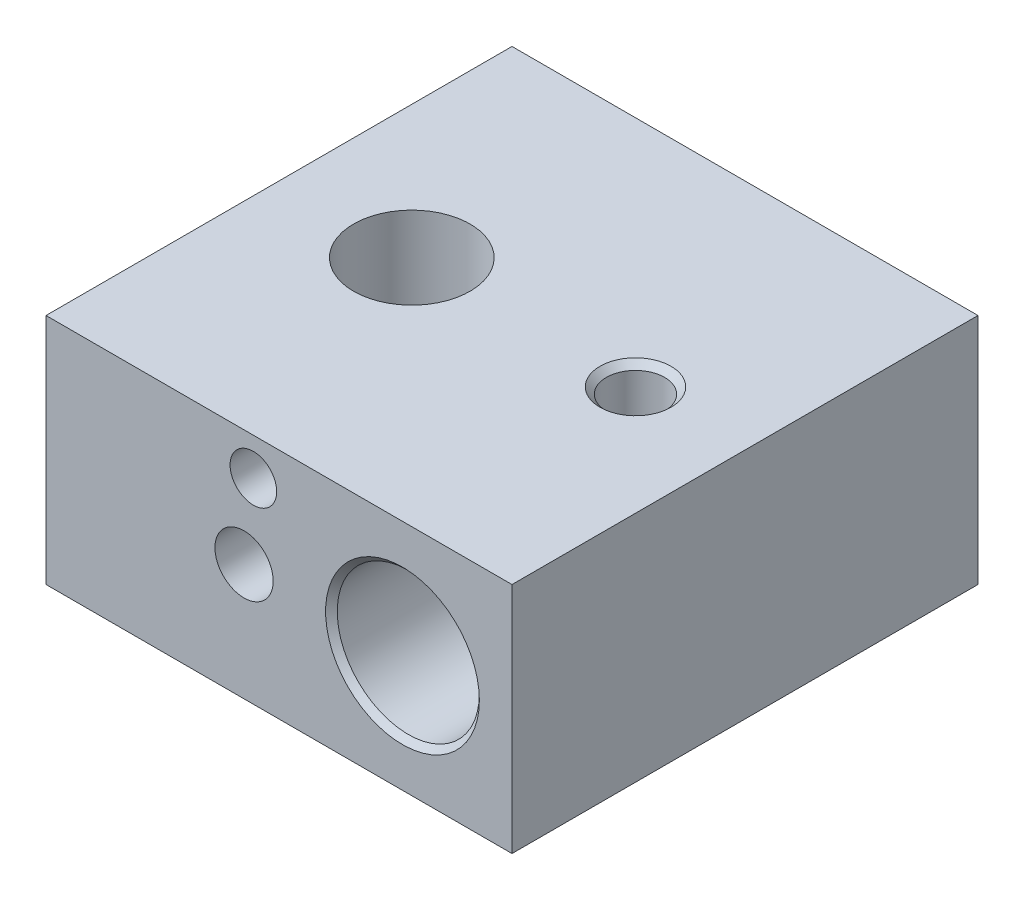
ISO-10303-21;
HEADER;
FILE_DESCRIPTION(('STEP AP214'),'2;1');
FILE_NAME('part.step','',(''),(''),'','','');
FILE_SCHEMA(('AUTOMOTIVE_DESIGN { 1 0 10303 214 1 1 1 1 }'));
ENDSEC;
DATA;
#1=APPLICATION_CONTEXT('core data for automotive mechanical design processes');
#2=APPLICATION_PROTOCOL_DEFINITION('international standard','automotive_design',2000,#1);
#3=PRODUCT_CONTEXT('',#1,'mechanical');
#4=PRODUCT('Part','Part','',(#3));
#5=PRODUCT_RELATED_PRODUCT_CATEGORY('part','',(#4));
#6=PRODUCT_DEFINITION_FORMATION('','',#4);
#7=PRODUCT_DEFINITION_CONTEXT('part definition',#1,'design');
#8=PRODUCT_DEFINITION('design','',#6,#7);
#9=PRODUCT_DEFINITION_SHAPE('','',#8);
#10=(LENGTH_UNIT() NAMED_UNIT(*) SI_UNIT(.MILLI.,.METRE.));
#11=(NAMED_UNIT(*) PLANE_ANGLE_UNIT() SI_UNIT($,.RADIAN.));
#12=(NAMED_UNIT(*) SI_UNIT($,.STERADIAN.) SOLID_ANGLE_UNIT());
#13=UNCERTAINTY_MEASURE_WITH_UNIT(LENGTH_MEASURE(1.E-05),#10,'distance_accuracy_value','');
#14=(GEOMETRIC_REPRESENTATION_CONTEXT(3) GLOBAL_UNCERTAINTY_ASSIGNED_CONTEXT((#13)) GLOBAL_UNIT_ASSIGNED_CONTEXT((#10,
#11,#12)) REPRESENTATION_CONTEXT('',''));
#15=CARTESIAN_POINT('',(0.,0.,0.));
#16=DIRECTION('',(0.,0.,1.));
#17=DIRECTION('',(1.,0.,0.));
#18=AXIS2_PLACEMENT_3D('',#15,#16,#17);
#19=CARTESIAN_POINT('',(-10.,10.,10.));
#20=DIRECTION('',(1.,0.,0.));
#21=DIRECTION('',(0.,0.,-1.));
#22=AXIS2_PLACEMENT_3D('',#19,#20,#21);
#23=PLANE('',#22);
#24=DIRECTION('',(0.,0.,1.));
#25=VECTOR('',#24,1.);
#26=CARTESIAN_POINT('',(-10.,0.,10.));
#27=LINE('',#26,#25);
#28=CARTESIAN_POINT('',(-10.,0.,-10.));
#29=VERTEX_POINT('',#28);
#30=CARTESIAN_POINT('',(-10.,0.,10.));
#31=VERTEX_POINT('',#30);
#32=EDGE_CURVE('E121',#29,#31,#27,.T.);
#33=ORIENTED_EDGE('',*,*,#32,.T.);
#34=DIRECTION('',(0.,-1.,0.));
#35=VECTOR('',#34,1.);
#36=CARTESIAN_POINT('',(-10.,10.,10.));
#37=LINE('',#36,#35);
#38=CARTESIAN_POINT('',(-10.,10.,10.));
#39=VERTEX_POINT('',#38);
#40=EDGE_CURVE('E11',#39,#31,#37,.T.);
#41=ORIENTED_EDGE('',*,*,#40,.F.);
#42=DIRECTION('',(0.,0.,1.));
#43=VECTOR('',#42,1.);
#44=CARTESIAN_POINT('',(-10.,10.,10.));
#45=LINE('',#44,#43);
#46=CARTESIAN_POINT('',(-10.,10.,-10.));
#47=VERTEX_POINT('',#46);
#48=EDGE_CURVE('E122',#47,#39,#45,.T.);
#49=ORIENTED_EDGE('',*,*,#48,.F.);
#50=DIRECTION('',(0.,-1.,0.));
#51=VECTOR('',#50,1.);
#52=CARTESIAN_POINT('',(-10.,10.,-10.));
#53=LINE('',#52,#51);
#54=EDGE_CURVE('E128',#47,#29,#53,.T.);
#55=ORIENTED_EDGE('',*,*,#54,.T.);
#56=EDGE_LOOP('',(#33,#41,#49,#55));
#57=FACE_BOUND('',#56,.T.);
#58=ADVANCED_FACE('F37',(#57),#23,.F.);
#59=CARTESIAN_POINT('',(10.,10.,10.));
#60=DIRECTION('',(0.,0.,-1.));
#61=DIRECTION('',(-1.,0.,0.));
#62=AXIS2_PLACEMENT_3D('',#59,#60,#61);
#63=PLANE('',#62);
#64=CARTESIAN_POINT('',(-1.1,8.4,10.));
#65=DIRECTION('',(0.,0.,1.));
#66=DIRECTION('',(1.,0.,0.));
#67=AXIS2_PLACEMENT_3D('',#64,#65,#66);
#68=CIRCLE('',#67,1.);
#69=CARTESIAN_POINT('',(-0.100000000000001,8.4,10.));
#70=VERTEX_POINT('',#69);
#71=EDGE_CURVE('E170',#70,#70,#68,.T.);
#72=ORIENTED_EDGE('',*,*,#71,.F.);
#73=EDGE_LOOP('',(#72));
#74=FACE_BOUND('',#73,.T.);
#75=CARTESIAN_POINT('',(-1.5,5.,10.));
#76=DIRECTION('',(0.,0.,1.));
#77=DIRECTION('',(1.,0.,0.));
#78=AXIS2_PLACEMENT_3D('',#75,#76,#77);
#79=CIRCLE('',#78,1.25);
#80=CARTESIAN_POINT('',(-0.25,5.,10.));
#81=VERTEX_POINT('',#80);
#82=EDGE_CURVE('E104',#81,#81,#79,.T.);
#83=ORIENTED_EDGE('',*,*,#82,.F.);
#84=EDGE_LOOP('',(#83));
#85=FACE_BOUND('',#84,.T.);
#86=CARTESIAN_POINT('',(5.3,5.,10.));
#87=DIRECTION('',(0.,0.,1.));
#88=DIRECTION('',(1.,0.,0.));
#89=AXIS2_PLACEMENT_3D('',#86,#87,#88);
#90=CIRCLE('',#89,3.3);
#91=CARTESIAN_POINT('',(8.6,5.,10.));
#92=VERTEX_POINT('',#91);
#93=EDGE_CURVE('E107',#92,#92,#90,.T.);
#94=ORIENTED_EDGE('',*,*,#93,.F.);
#95=EDGE_LOOP('',(#94));
#96=FACE_BOUND('',#95,.T.);
#97=DIRECTION('',(1.,0.,0.));
#98=VECTOR('',#97,1.);
#99=CARTESIAN_POINT('',(10.,0.,10.));
#100=LINE('',#99,#98);
#101=CARTESIAN_POINT('',(10.,0.,10.));
#102=VERTEX_POINT('',#101);
#103=EDGE_CURVE('E131',#31,#102,#100,.T.);
#104=ORIENTED_EDGE('',*,*,#103,.T.);
#105=DIRECTION('',(0.,-1.,0.));
#106=VECTOR('',#105,1.);
#107=CARTESIAN_POINT('',(10.,10.,10.));
#108=LINE('',#107,#106);
#109=CARTESIAN_POINT('',(10.,10.,10.));
#110=VERTEX_POINT('',#109);
#111=EDGE_CURVE('E50',#110,#102,#108,.T.);
#112=ORIENTED_EDGE('',*,*,#111,.F.);
#113=DIRECTION('',(1.,0.,0.));
#114=VECTOR('',#113,1.);
#115=CARTESIAN_POINT('',(10.,10.,10.));
#116=LINE('',#115,#114);
#117=EDGE_CURVE('E89',#39,#110,#116,.T.);
#118=ORIENTED_EDGE('',*,*,#117,.F.);
#119=ORIENTED_EDGE('',*,*,#40,.T.);
#120=EDGE_LOOP('',(#104,#112,#118,#119));
#121=FACE_BOUND('',#120,.T.);
#122=ADVANCED_FACE('F157',(#74,#85,#96,#121),#63,.F.);
#123=CARTESIAN_POINT('',(10.,10.,10.));
#124=DIRECTION('',(-1.,0.,0.));
#125=DIRECTION('',(0.,0.,1.));
#126=AXIS2_PLACEMENT_3D('',#123,#124,#125);
#127=PLANE('',#126);
#128=DIRECTION('',(0.,0.,-1.));
#129=VECTOR('',#128,1.);
#130=CARTESIAN_POINT('',(10.,0.,10.));
#131=LINE('',#130,#129);
#132=CARTESIAN_POINT('',(10.,0.,-10.));
#133=VERTEX_POINT('',#132);
#134=EDGE_CURVE('E76',#102,#133,#131,.T.);
#135=ORIENTED_EDGE('',*,*,#134,.T.);
#136=DIRECTION('',(0.,-1.,0.));
#137=VECTOR('',#136,1.);
#138=CARTESIAN_POINT('',(10.,10.,-10.));
#139=LINE('',#138,#137);
#140=CARTESIAN_POINT('',(10.,10.,-10.));
#141=VERTEX_POINT('',#140);
#142=EDGE_CURVE('E136',#141,#133,#139,.T.);
#143=ORIENTED_EDGE('',*,*,#142,.F.);
#144=DIRECTION('',(0.,0.,-1.));
#145=VECTOR('',#144,1.);
#146=CARTESIAN_POINT('',(10.,10.,10.));
#147=LINE('',#146,#145);
#148=EDGE_CURVE('E125',#110,#141,#147,.T.);
#149=ORIENTED_EDGE('',*,*,#148,.F.);
#150=ORIENTED_EDGE('',*,*,#111,.T.);
#151=EDGE_LOOP('',(#135,#143,#149,#150));
#152=FACE_BOUND('',#151,.T.);
#153=ADVANCED_FACE('F139',(#152),#127,.F.);
#154=CARTESIAN_POINT('',(10.,10.,-10.));
#155=DIRECTION('',(0.,0.,1.));
#156=DIRECTION('',(1.,0.,0.));
#157=AXIS2_PLACEMENT_3D('',#154,#155,#156);
#158=PLANE('',#157);
#159=CARTESIAN_POINT('',(5.3,5.,-10.));
#160=DIRECTION('',(0.,0.,1.));
#161=DIRECTION('',(1.,0.,0.));
#162=AXIS2_PLACEMENT_3D('',#159,#160,#161);
#163=CIRCLE('',#162,3.29999999999999);
#164=CARTESIAN_POINT('',(8.59999999999999,5.,-10.));
#165=VERTEX_POINT('',#164);
#166=EDGE_CURVE('E103',#165,#165,#163,.T.);
#167=ORIENTED_EDGE('',*,*,#166,.T.);
#168=EDGE_LOOP('',(#167));
#169=FACE_BOUND('',#168,.T.);
#170=DIRECTION('',(-1.,0.,0.));
#171=VECTOR('',#170,1.);
#172=CARTESIAN_POINT('',(10.,0.,-10.));
#173=LINE('',#172,#171);
#174=EDGE_CURVE('E82',#133,#29,#173,.T.);
#175=ORIENTED_EDGE('',*,*,#174,.T.);
#176=ORIENTED_EDGE('',*,*,#54,.F.);
#177=DIRECTION('',(-1.,0.,0.));
#178=VECTOR('',#177,1.);
#179=CARTESIAN_POINT('',(10.,10.,-10.));
#180=LINE('',#179,#178);
#181=EDGE_CURVE('E58',#141,#47,#180,.T.);
#182=ORIENTED_EDGE('',*,*,#181,.F.);
#183=ORIENTED_EDGE('',*,*,#142,.T.);
#184=EDGE_LOOP('',(#175,#176,#182,#183));
#185=FACE_BOUND('',#184,.T.);
#186=ADVANCED_FACE('F146',(#169,#185),#158,.F.);
#187=CARTESIAN_POINT('',(0.,10.,0.));
#188=DIRECTION('',(0.,1.,0.));
#189=DIRECTION('',(0.,0.,1.));
#190=AXIS2_PLACEMENT_3D('',#187,#188,#189);
#191=PLANE('',#190);
#192=CARTESIAN_POINT('',(-4.3,10.,0.));
#193=DIRECTION('',(0.,1.,0.));
#194=DIRECTION('',(0.,0.,1.));
#195=AXIS2_PLACEMENT_3D('',#192,#193,#194);
#196=CIRCLE('',#195,2.5);
#197=CARTESIAN_POINT('',(-4.3,10.,2.5));
#198=VERTEX_POINT('',#197);
#199=EDGE_CURVE('E199',#198,#198,#196,.T.);
#200=ORIENTED_EDGE('',*,*,#199,.F.);
#201=EDGE_LOOP('',(#200));
#202=FACE_BOUND('',#201,.T.);
#203=CARTESIAN_POINT('',(5.3,10.,0.));
#204=DIRECTION('',(0.,1.,0.));
#205=DIRECTION('',(0.,0.,1.));
#206=AXIS2_PLACEMENT_3D('',#203,#204,#205);
#207=CIRCLE('',#206,1.525);
#208=CARTESIAN_POINT('',(5.3,10.,1.525));
#209=VERTEX_POINT('',#208);
#210=EDGE_CURVE('E198',#209,#209,#207,.T.);
#211=ORIENTED_EDGE('',*,*,#210,.F.);
#212=EDGE_LOOP('',(#211));
#213=FACE_BOUND('',#212,.T.);
#214=ORIENTED_EDGE('',*,*,#48,.T.);
#215=ORIENTED_EDGE('',*,*,#117,.T.);
#216=ORIENTED_EDGE('',*,*,#148,.T.);
#217=ORIENTED_EDGE('',*,*,#181,.T.);
#218=EDGE_LOOP('',(#214,#215,#216,#217));
#219=FACE_BOUND('',#218,.T.);
#220=ADVANCED_FACE('F148',(#202,#213,#219),#191,.T.);
#221=CARTESIAN_POINT('',(0.,0.,0.));
#222=DIRECTION('',(0.,1.,0.));
#223=DIRECTION('',(0.,0.,1.));
#224=AXIS2_PLACEMENT_3D('',#221,#222,#223);
#225=PLANE('',#224);
#226=CARTESIAN_POINT('',(-4.3,0.,0.));
#227=DIRECTION('',(0.,1.,0.));
#228=DIRECTION('',(0.,0.,1.));
#229=AXIS2_PLACEMENT_3D('',#226,#227,#228);
#230=CIRCLE('',#229,2.5);
#231=CARTESIAN_POINT('',(-4.3,0.,2.5));
#232=VERTEX_POINT('',#231);
#233=EDGE_CURVE('E196',#232,#232,#230,.T.);
#234=ORIENTED_EDGE('',*,*,#233,.T.);
#235=EDGE_LOOP('',(#234));
#236=FACE_BOUND('',#235,.T.);
#237=ORIENTED_EDGE('',*,*,#32,.F.);
#238=ORIENTED_EDGE('',*,*,#174,.F.);
#239=ORIENTED_EDGE('',*,*,#134,.F.);
#240=ORIENTED_EDGE('',*,*,#103,.F.);
#241=EDGE_LOOP('',(#237,#238,#239,#240));
#242=FACE_BOUND('',#241,.T.);
#243=ADVANCED_FACE('F142',(#236,#242),#225,.F.);
#244=CARTESIAN_POINT('',(5.3,5.,-9.75));
#245=DIRECTION('',(0.,0.,-1.));
#246=DIRECTION('',(-1.,0.,0.));
#247=AXIS2_PLACEMENT_3D('',#244,#245,#246);
#248=CONICAL_SURFACE('',#247,3.05,0.785398163397438);
#249=ORIENTED_EDGE('',*,*,#166,.F.);
#250=EDGE_LOOP('',(#249));
#251=FACE_BOUND('',#250,.T.);
#252=CARTESIAN_POINT('',(5.3,5.,-9.75));
#253=DIRECTION('',(0.,0.,1.));
#254=DIRECTION('',(1.,0.,0.));
#255=AXIS2_PLACEMENT_3D('',#252,#253,#254);
#256=CIRCLE('',#255,3.05);
#257=CARTESIAN_POINT('',(8.35,5.,-9.75));
#258=VERTEX_POINT('',#257);
#259=EDGE_CURVE('E118',#258,#258,#256,.T.);
#260=ORIENTED_EDGE('',*,*,#259,.T.);
#261=EDGE_LOOP('',(#260));
#262=FACE_BOUND('',#261,.T.);
#263=ADVANCED_FACE('F182',(#251,#262),#248,.F.);
#264=CARTESIAN_POINT('',(5.3,5.,10.));
#265=DIRECTION('',(0.,0.,1.));
#266=DIRECTION('',(1.,0.,0.));
#267=AXIS2_PLACEMENT_3D('',#264,#265,#266);
#268=CYLINDRICAL_SURFACE('',#267,3.05);
#269=CARTESIAN_POINT('',(5.3,8.05,1.25));
#270=CARTESIAN_POINT('',(5.36705105449435,8.0499949013604,1.24999317358084));
#271=CARTESIAN_POINT('',(5.43421220939516,8.04776316601173,1.2445728904159));
#272=CARTESIAN_POINT('',(5.56663531512961,8.03905220749816,1.22308214272691));
#273=CARTESIAN_POINT('',(5.63189174087961,8.03256170556949,1.2069833965083));
#274=CARTESIAN_POINT('',(5.75837429284752,8.01603149034563,1.16482596800736));
#275=CARTESIAN_POINT('',(5.8196130929358,8.00600364451594,1.13880056530878));
#276=CARTESIAN_POINT('',(5.93679775394015,7.98337979201622,1.07766372514542));
#277=CARTESIAN_POINT('',(5.99274530666015,7.97078461030852,1.04255520538644));
#278=CARTESIAN_POINT('',(6.10058268229026,7.94360272183732,0.962433598338682));
#279=CARTESIAN_POINT('',(6.15217961883631,7.92895218720805,0.917048137846256));
#280=CARTESIAN_POINT('',(6.24727980579278,7.8995935820288,0.818447693953154));
#281=CARTESIAN_POINT('',(6.29077892161812,7.8848854859807,0.765228735620993));
#282=CARTESIAN_POINT('',(6.37047635819198,7.85630174305003,0.649422087968709));
#283=CARTESIAN_POINT('',(6.40623272255294,7.84249824263372,0.586510586657886));
#284=CARTESIAN_POINT('',(6.46652509902148,7.81829427065234,0.454917226841783));
#285=CARTESIAN_POINT('',(6.4910667050528,7.80789210323985,0.386238265428793));
#286=CARTESIAN_POINT('',(6.527033698322,7.79235707938261,0.248428842832731));
#287=CARTESIAN_POINT('',(6.53902161527503,7.78699943260883,0.179471492843171));
#288=CARTESIAN_POINT('',(6.55129693566521,7.78151145539132,0.0403318756690735));
#289=CARTESIAN_POINT('',(6.55159049579919,7.78137837438493,-0.0298497275147832));
#290=CARTESIAN_POINT('',(6.54089353762405,7.78616368996563,-0.163925901590138));
#291=CARTESIAN_POINT('',(6.53073314256809,7.79071047916049,-0.227902592734093));
#292=CARTESIAN_POINT('',(6.50080567936669,7.80371701324257,-0.353147282962073));
#293=CARTESIAN_POINT('',(6.48103684064336,7.81217747930137,-0.414414780543532));
#294=CARTESIAN_POINT('',(6.43207159424285,7.83224715740188,-0.534021432652648));
#295=CARTESIAN_POINT('',(6.40268647565431,7.8439185833376,-0.592272424650278));
#296=CARTESIAN_POINT('',(6.33545581744839,7.8690795378448,-0.703238106802876));
#297=CARTESIAN_POINT('',(6.2976070046597,7.88256976900066,-0.755950643442825));
#298=CARTESIAN_POINT('',(6.21089979031178,7.91118669367845,-0.858864937284254));
#299=CARTESIAN_POINT('',(6.16139546177047,7.92635714795841,-0.908511828807876));
#300=CARTESIAN_POINT('',(6.05460843164101,7.95569448523891,-0.998981661817665));
#301=CARTESIAN_POINT('',(5.99732402821036,7.96986114763167,-1.03980266761885));
#302=CARTESIAN_POINT('',(5.87496342854658,7.9959821432301,-1.11223980523006));
#303=CARTESIAN_POINT('',(5.80974527572702,8.00788187819974,-1.14363728064277));
#304=CARTESIAN_POINT('',(5.67434088842293,8.02771185130719,-1.19482196887004));
#305=CARTESIAN_POINT('',(5.60415733016857,8.0356442094366,-1.21461538335977));
#306=CARTESIAN_POINT('',(5.46545720041041,8.04625363825052,-1.24088500214244));
#307=CARTESIAN_POINT('',(5.39710415103709,8.04922426910946,-1.24810627215568));
#308=CARTESIAN_POINT('',(5.26010441371817,8.0505074612745,-1.25123907850245));
#309=CARTESIAN_POINT('',(5.19145781182912,8.04882130524731,-1.24715372913384));
#310=CARTESIAN_POINT('',(5.05926209998629,8.04117156509261,-1.22832878266846));
#311=CARTESIAN_POINT('',(4.99562598291882,8.03541570476584,-1.21410632521057));
#312=CARTESIAN_POINT('',(4.87170816248345,8.02042451329165,-1.17612394528366));
#313=CARTESIAN_POINT('',(4.81142688721188,8.01118873925112,-1.15236280878941));
#314=CARTESIAN_POINT('',(4.69383011012163,7.9897729532255,-1.09520071595727));
#315=CARTESIAN_POINT('',(4.63666382302296,7.97751077732145,-1.06152455804877));
#316=CARTESIAN_POINT('',(4.52859041874229,7.95135965585715,-0.98579188360698));
#317=CARTESIAN_POINT('',(4.47768588879936,7.93747004246777,-0.943731921728039));
#318=CARTESIAN_POINT('',(4.37987991098665,7.90837761739879,-0.849015596000581));
#319=CARTESIAN_POINT('',(4.33349954211682,7.89315046142814,-0.795827240559546));
#320=CARTESIAN_POINT('',(4.25018452435906,7.86397295744692,-0.682168042389588));
#321=CARTESIAN_POINT('',(4.21325176747518,7.85002286554324,-0.621695744519814));
#322=CARTESIAN_POINT('',(4.14955272757803,7.82491824303051,-0.494080642799381));
#323=CARTESIAN_POINT('',(4.12291696039833,7.8138001745101,-0.426864996442404));
#324=CARTESIAN_POINT('',(4.08156002386075,7.79614362783962,-0.288305958715392));
#325=CARTESIAN_POINT('',(4.0668294602223,7.78960153937764,-0.216965869632516));
#326=CARTESIAN_POINT('',(4.05061997017984,7.78237686582237,-0.0779442828042258));
#327=CARTESIAN_POINT('',(4.04823064874134,7.78129189039513,-0.010389284598138));
#328=CARTESIAN_POINT('',(4.054357417322,7.78404131006804,0.124115415101154));
#329=CARTESIAN_POINT('',(4.06287195937366,7.78787500688879,0.191065201154604));
#330=CARTESIAN_POINT('',(4.08980857539514,7.79966724973413,0.319459584533195));
#331=CARTESIAN_POINT('',(4.10778270632241,7.80743875303861,0.38101694579431));
#332=CARTESIAN_POINT('',(4.15269826055875,7.82609039777681,0.500260930445375));
#333=CARTESIAN_POINT('',(4.17964218632338,7.83697140660187,0.557946468244504));
#334=CARTESIAN_POINT('',(4.24356546820025,7.86141244323641,0.671520528671245));
#335=CARTESIAN_POINT('',(4.2810430499474,7.87509264152987,0.727102315583994));
#336=CARTESIAN_POINT('',(4.36425954659735,7.90324259102355,0.831473336340559));
#337=CARTESIAN_POINT('',(4.41000117381969,7.91771260035406,0.880260330746795));
#338=CARTESIAN_POINT('',(4.51222488066987,7.94701985281454,0.973140820244658));
#339=CARTESIAN_POINT('',(4.5692324065468,7.961812751821,1.01667265144534));
#340=CARTESIAN_POINT('',(4.6902973700519,7.98908126299053,1.09357367951556));
#341=CARTESIAN_POINT('',(4.75435802331351,8.00155581115557,1.12693821461591));
#342=CARTESIAN_POINT('',(4.88663629870452,8.02258806460314,1.18180811191665));
#343=CARTESIAN_POINT('',(4.95476171520483,8.03121040731175,1.20351052450806));
#344=CARTESIAN_POINT('',(5.0939961675334,8.04383134859934,1.23495872650017));
#345=CARTESIAN_POINT('',(5.16509507070934,8.04784450441533,1.24474216568277));
#346=CARTESIAN_POINT('',(5.25760124338891,8.04978053015449,1.24946289651355));
#347=CARTESIAN_POINT('',(5.27879511590617,8.05000161244387,1.25000215885385));
#348=CARTESIAN_POINT('',(5.3,8.05,1.25));
#349=B_SPLINE_CURVE_WITH_KNOTS('',3,(#269,#270,#271,#272,#273,#274,#275,#276,#277,#278,#279,
#280,#281,#282,#283,#284,#285,#286,#287,#288,#289,#290,#291,#292,#293,#294,#295,#296,#297,#298,
#299,#300,#301,#302,#303,#304,#305,#306,#307,#308,#309,#310,#311,#312,#313,#314,#315,#316,#317,
#318,#319,#320,#321,#322,#323,#324,#325,#326,#327,#328,#329,#330,#331,#332,#333,#334,#335,#336,
#337,#338,#339,#340,#341,#342,#343,#344,#345,#346,#347,#348),.UNSPECIFIED.,.T.,.F.,(4,2,2,2,2,2,
2,2,2,2,2,2,2,2,2,2,2,2,2,2,2,2,2,2,2,2,2,2,2,2,2,2,2,2,2,2,2,2,2,4),(0.,0.201094311180327,
0.402723354574275,0.603682285542812,0.804576743863709,1.0144449209133,1.22441996030868,
1.4443140997696,1.66409843594336,1.87354721803841,2.08288573073389,2.27679448285736,
2.47073898070665,2.66874390795883,2.86682554265504,3.08105274490334,3.29532688370777,
3.51424468844057,3.73304538781655,3.93837132545349,4.14364071369573,4.33912550528583,
4.53463518488674,4.73618655641971,4.93782092740472,5.15341391236426,5.36905003881045,
5.58733616568888,5.80544987646515,6.00721727204664,6.20895602688516,6.40190297186303,
6.59490379169179,6.79928960640034,7.00374262427851,7.2224017824937,7.44116104698127,
7.65609749208751,7.87035321839585,7.93394925864706),.UNSPECIFIED.);
#350=CARTESIAN_POINT('',(5.3,8.05,1.25));
#351=VERTEX_POINT('',#350);
#352=EDGE_CURVE('E40',#351,#351,#349,.T.);
#353=ORIENTED_EDGE('',*,*,#352,.T.);
#354=EDGE_LOOP('',(#353));
#355=FACE_BOUND('',#354,.T.);
#356=ORIENTED_EDGE('',*,*,#259,.F.);
#357=EDGE_LOOP('',(#356));
#358=FACE_BOUND('',#357,.T.);
#359=CARTESIAN_POINT('',(5.3,5.,9.74999999999999));
#360=DIRECTION('',(0.,0.,1.));
#361=DIRECTION('',(1.,0.,0.));
#362=AXIS2_PLACEMENT_3D('',#359,#360,#361);
#363=CIRCLE('',#362,3.05);
#364=CARTESIAN_POINT('',(8.35,5.,9.74999999999999));
#365=VERTEX_POINT('',#364);
#366=EDGE_CURVE('E115',#365,#365,#363,.T.);
#367=ORIENTED_EDGE('',*,*,#366,.T.);
#368=EDGE_LOOP('',(#367));
#369=FACE_BOUND('',#368,.T.);
#370=ADVANCED_FACE('F176',(#355,#358,#369),#268,.F.);
#371=CARTESIAN_POINT('',(5.3,5.,10.));
#372=DIRECTION('',(0.,0.,1.));
#373=DIRECTION('',(1.,0.,0.));
#374=AXIS2_PLACEMENT_3D('',#371,#372,#373);
#375=CONICAL_SURFACE('',#374,3.3,0.785398163397438);
#376=ORIENTED_EDGE('',*,*,#366,.F.);
#377=EDGE_LOOP('',(#376));
#378=FACE_BOUND('',#377,.T.);
#379=ORIENTED_EDGE('',*,*,#93,.T.);
#380=EDGE_LOOP('',(#379));
#381=FACE_BOUND('',#380,.T.);
#382=ADVANCED_FACE('F97',(#378,#381),#375,.F.);
#383=CARTESIAN_POINT('',(-1.5,5.,5.));
#384=DIRECTION('',(0.,0.,1.));
#385=DIRECTION('',(1.,0.,0.));
#386=AXIS2_PLACEMENT_3D('',#383,#384,#385);
#387=CONICAL_SURFACE('',#386,1.25,1.02974425867665);
#388=CARTESIAN_POINT('',(-1.5,5.,4.24892422621555));
#389=VERTEX_POINT('',#388);
#390=VERTEX_LOOP('',#389);
#391=FACE_BOUND('',#390,.T.);
#392=CARTESIAN_POINT('',(-1.5,5.,5.));
#393=DIRECTION('',(0.,0.,1.));
#394=DIRECTION('',(1.,0.,0.));
#395=AXIS2_PLACEMENT_3D('',#392,#393,#394);
#396=CIRCLE('',#395,1.25);
#397=CARTESIAN_POINT('',(-0.250000000000001,5.,5.));
#398=VERTEX_POINT('',#397);
#399=EDGE_CURVE('E101',#398,#398,#396,.T.);
#400=ORIENTED_EDGE('',*,*,#399,.T.);
#401=EDGE_LOOP('',(#400));
#402=FACE_BOUND('',#401,.T.);
#403=ADVANCED_FACE('F93',(#391,#402),#387,.F.);
#404=CARTESIAN_POINT('',(-1.5,5.,10.));
#405=DIRECTION('',(0.,0.,1.));
#406=DIRECTION('',(1.,0.,0.));
#407=AXIS2_PLACEMENT_3D('',#404,#405,#406);
#408=CYLINDRICAL_SURFACE('',#407,1.25);
#409=ORIENTED_EDGE('',*,*,#399,.F.);
#410=EDGE_LOOP('',(#409));
#411=FACE_BOUND('',#410,.T.);
#412=ORIENTED_EDGE('',*,*,#82,.T.);
#413=EDGE_LOOP('',(#412));
#414=FACE_BOUND('',#413,.T.);
#415=ADVANCED_FACE('F96',(#411,#414),#408,.F.);
#416=CARTESIAN_POINT('',(5.3,10.,0.));
#417=DIRECTION('',(0.,1.,0.));
#418=DIRECTION('',(0.,0.,1.));
#419=AXIS2_PLACEMENT_3D('',#416,#417,#418);
#420=CYLINDRICAL_SURFACE('',#419,1.25);
#421=CARTESIAN_POINT('',(5.3,9.725,0.));
#422=DIRECTION('',(0.,1.,0.));
#423=DIRECTION('',(0.,0.,1.));
#424=AXIS2_PLACEMENT_3D('',#421,#422,#423);
#425=CIRCLE('',#424,1.25);
#426=CARTESIAN_POINT('',(5.3,9.725,1.25));
#427=VERTEX_POINT('',#426);
#428=EDGE_CURVE('E202',#427,#427,#425,.T.);
#429=ORIENTED_EDGE('',*,*,#428,.T.);
#430=EDGE_LOOP('',(#429));
#431=FACE_BOUND('',#430,.T.);
#432=ORIENTED_EDGE('',*,*,#352,.F.);
#433=EDGE_LOOP('',(#432));
#434=FACE_BOUND('',#433,.T.);
#435=ADVANCED_FACE('F216',(#431,#434),#420,.F.);
#436=CARTESIAN_POINT('',(5.3,10.,0.));
#437=DIRECTION('',(0.,1.,0.));
#438=DIRECTION('',(0.,0.,1.));
#439=AXIS2_PLACEMENT_3D('',#436,#437,#438);
#440=CONICAL_SURFACE('',#439,1.525,0.78539816339745);
#441=ORIENTED_EDGE('',*,*,#428,.F.);
#442=EDGE_LOOP('',(#441));
#443=FACE_BOUND('',#442,.T.);
#444=ORIENTED_EDGE('',*,*,#210,.T.);
#445=EDGE_LOOP('',(#444));
#446=FACE_BOUND('',#445,.T.);
#447=ADVANCED_FACE('F218',(#443,#446),#440,.F.);
#448=CARTESIAN_POINT('',(-4.3,0.,0.));
#449=DIRECTION('',(0.,1.,0.));
#450=DIRECTION('',(0.,0.,1.));
#451=AXIS2_PLACEMENT_3D('',#448,#449,#450);
#452=CYLINDRICAL_SURFACE('',#451,2.5);
#453=ORIENTED_EDGE('',*,*,#233,.F.);
#454=EDGE_LOOP('',(#453));
#455=FACE_BOUND('',#454,.T.);
#456=ORIENTED_EDGE('',*,*,#199,.T.);
#457=EDGE_LOOP('',(#456));
#458=FACE_BOUND('',#457,.T.);
#459=ADVANCED_FACE('F223',(#455,#458),#452,.F.);
#460=CARTESIAN_POINT('',(-1.1,8.4,7.));
#461=DIRECTION('',(0.,0.,1.));
#462=DIRECTION('',(1.,0.,0.));
#463=AXIS2_PLACEMENT_3D('',#460,#461,#462);
#464=CYLINDRICAL_SURFACE('',#463,1.);
#465=CARTESIAN_POINT('',(-1.1,8.4,7.));
#466=DIRECTION('',(0.,0.,1.));
#467=DIRECTION('',(1.,0.,0.));
#468=AXIS2_PLACEMENT_3D('',#465,#466,#467);
#469=CIRCLE('',#468,1.);
#470=CARTESIAN_POINT('',(-0.100000000000001,8.4,7.));
#471=VERTEX_POINT('',#470);
#472=EDGE_CURVE('E205',#471,#471,#469,.T.);
#473=ORIENTED_EDGE('',*,*,#472,.F.);
#474=EDGE_LOOP('',(#473));
#475=FACE_BOUND('',#474,.T.);
#476=ORIENTED_EDGE('',*,*,#71,.T.);
#477=EDGE_LOOP('',(#476));
#478=FACE_BOUND('',#477,.T.);
#479=ADVANCED_FACE('F230',(#475,#478),#464,.F.);
#480=CARTESIAN_POINT('',(-1.1,8.4,7.));
#481=DIRECTION('',(0.,0.,1.));
#482=DIRECTION('',(1.,0.,0.));
#483=AXIS2_PLACEMENT_3D('',#480,#481,#482);
#484=PLANE('',#483);
#485=ORIENTED_EDGE('',*,*,#472,.T.);
#486=EDGE_LOOP('',(#485));
#487=FACE_BOUND('',#486,.T.);
#488=ADVANCED_FACE('F233',(#487),#484,.T.);
#489=CLOSED_SHELL('',(#58,#122,#153,#186,#220,#243,#263,#370,#382,#403,#415,#435,#447,#459,#479,#488));
#490=MANIFOLD_SOLID_BREP('B2',#489);
#491=ADVANCED_BREP_SHAPE_REPRESENTATION('',(#18,#490),#14);
#492=SHAPE_DEFINITION_REPRESENTATION(#9,#491);
ENDSEC;
END-ISO-10303-21;
